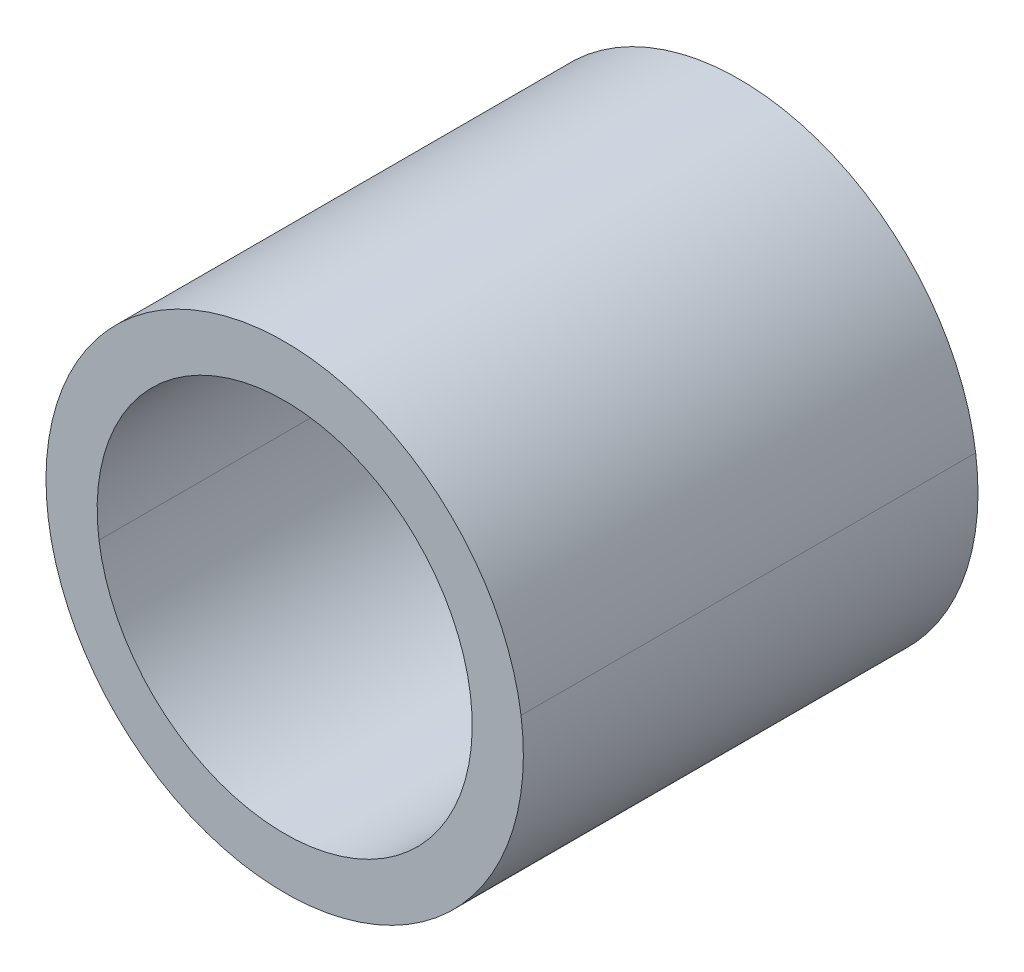
ISO-10303-21;
HEADER;
FILE_DESCRIPTION(('STEP AP214'),'2;1');
FILE_NAME('part.step','',(''),(''),'','','');
FILE_SCHEMA(('AUTOMOTIVE_DESIGN { 1 0 10303 214 1 1 1 1 }'));
ENDSEC;
DATA;
#1=APPLICATION_CONTEXT('core data for automotive mechanical design processes');
#2=APPLICATION_PROTOCOL_DEFINITION('international standard','automotive_design',2000,#1);
#3=PRODUCT_CONTEXT('',#1,'mechanical');
#4=PRODUCT('Part','Part','',(#3));
#5=PRODUCT_RELATED_PRODUCT_CATEGORY('part','',(#4));
#6=PRODUCT_DEFINITION_FORMATION('','',#4);
#7=PRODUCT_DEFINITION_CONTEXT('part definition',#1,'design');
#8=PRODUCT_DEFINITION('design','',#6,#7);
#9=PRODUCT_DEFINITION_SHAPE('','',#8);
#10=(LENGTH_UNIT() NAMED_UNIT(*) SI_UNIT(.MILLI.,.METRE.));
#11=(NAMED_UNIT(*) PLANE_ANGLE_UNIT() SI_UNIT($,.RADIAN.));
#12=(NAMED_UNIT(*) SI_UNIT($,.STERADIAN.) SOLID_ANGLE_UNIT());
#13=UNCERTAINTY_MEASURE_WITH_UNIT(LENGTH_MEASURE(1.E-05),#10,'distance_accuracy_value','');
#14=(GEOMETRIC_REPRESENTATION_CONTEXT(3) GLOBAL_UNCERTAINTY_ASSIGNED_CONTEXT((#13)) GLOBAL_UNIT_ASSIGNED_CONTEXT((#10,
#11,#12)) REPRESENTATION_CONTEXT('',''));
#15=CARTESIAN_POINT('',(0.,0.,0.));
#16=DIRECTION('',(0.,0.,1.));
#17=DIRECTION('',(1.,0.,0.));
#18=AXIS2_PLACEMENT_3D('',#15,#16,#17);
#19=CARTESIAN_POINT('',(-7.48965146438231,-0.284044859426387,-18.3));
#20=DIRECTION('',(0.,0.,-1.));
#21=DIRECTION('',(0.990268068741566,0.139173100960095,0.));
#22=AXIS2_PLACEMENT_3D('',#19,#20,#21);
#23=CYLINDRICAL_SURFACE('',#22,0.825);
#24=DIRECTION('',(0.,0.,-1.));
#25=VECTOR('',#24,1.);
#26=CARTESIAN_POINT('',(-6.67268030767052,-0.169227051134309,-15.8));
#27=LINE('',#26,#25);
#28=CARTESIAN_POINT('',(-6.67268030767052,-0.169227051134309,-15.8));
#29=VERTEX_POINT('',#28);
#30=CARTESIAN_POINT('',(-6.67268030767052,-0.169227051134309,-17.8));
#31=VERTEX_POINT('',#30);
#32=EDGE_CURVE('E11',#29,#31,#27,.T.);
#33=ORIENTED_EDGE('',*,*,#32,.T.);
#34=CARTESIAN_POINT('',(-7.48965146438231,-0.284044859426387,-17.8));
#35=DIRECTION('',(0.,0.,1.));
#36=DIRECTION('',(-0.990268068741566,-0.139173100960095,0.));
#37=AXIS2_PLACEMENT_3D('',#34,#35,#36);
#38=CIRCLE('',#37,0.825);
#39=CARTESIAN_POINT('',(-8.30662262109411,-0.398862667718466,-17.8));
#40=VERTEX_POINT('',#39);
#41=EDGE_CURVE('E66',#40,#31,#38,.T.);
#42=ORIENTED_EDGE('',*,*,#41,.F.);
#43=DIRECTION('',(0.,0.,-1.));
#44=VECTOR('',#43,1.);
#45=CARTESIAN_POINT('',(-8.30662262109411,-0.398862667718466,-15.8));
#46=LINE('',#45,#44);
#47=CARTESIAN_POINT('',(-8.30662262109411,-0.398862667718466,-15.8));
#48=VERTEX_POINT('',#47);
#49=EDGE_CURVE('E25',#48,#40,#46,.T.);
#50=ORIENTED_EDGE('',*,*,#49,.F.);
#51=CARTESIAN_POINT('',(-7.48965146438231,-0.284044859426387,-15.8));
#52=DIRECTION('',(0.,0.,-1.));
#53=DIRECTION('',(0.990268068741566,0.139173100960095,0.));
#54=AXIS2_PLACEMENT_3D('',#51,#52,#53);
#55=CIRCLE('',#54,0.825);
#56=EDGE_CURVE('E63',#29,#48,#55,.T.);
#57=ORIENTED_EDGE('',*,*,#56,.F.);
#58=EDGE_LOOP('',(#33,#42,#50,#57));
#59=FACE_BOUND('',#58,.T.);
#60=ADVANCED_FACE('F17',(#59),#23,.F.);
#61=CARTESIAN_POINT('',(-7.48965146438231,-0.284044859426387,-18.3));
#62=DIRECTION('',(0.,0.,-1.));
#63=DIRECTION('',(0.990268068741566,0.139173100960095,0.));
#64=AXIS2_PLACEMENT_3D('',#61,#62,#63);
#65=CYLINDRICAL_SURFACE('',#64,0.825);
#66=ORIENTED_EDGE('',*,*,#49,.T.);
#67=CARTESIAN_POINT('',(-7.48965146438231,-0.284044859426387,-17.8));
#68=DIRECTION('',(0.,0.,1.));
#69=DIRECTION('',(0.990268068741566,0.139173100960095,0.));
#70=AXIS2_PLACEMENT_3D('',#67,#68,#69);
#71=CIRCLE('',#70,0.825);
#72=EDGE_CURVE('E68',#31,#40,#71,.T.);
#73=ORIENTED_EDGE('',*,*,#72,.F.);
#74=ORIENTED_EDGE('',*,*,#32,.F.);
#75=CARTESIAN_POINT('',(-7.48965146438231,-0.284044859426387,-15.8));
#76=DIRECTION('',(0.,0.,-1.));
#77=DIRECTION('',(-0.990268068741566,-0.139173100960095,0.));
#78=AXIS2_PLACEMENT_3D('',#75,#76,#77);
#79=CIRCLE('',#78,0.825);
#80=EDGE_CURVE('E72',#48,#29,#79,.T.);
#81=ORIENTED_EDGE('',*,*,#80,.F.);
#82=EDGE_LOOP('',(#66,#73,#74,#81));
#83=FACE_BOUND('',#82,.T.);
#84=ADVANCED_FACE('F76',(#83),#65,.F.);
#85=CARTESIAN_POINT('',(-7.48965146438231,-0.284044859426387,-17.8));
#86=DIRECTION('',(0.,0.,1.));
#87=DIRECTION('',(1.,0.,0.));
#88=AXIS2_PLACEMENT_3D('',#85,#86,#87);
#89=PLANE('',#88);
#90=ORIENTED_EDGE('',*,*,#41,.T.);
#91=ORIENTED_EDGE('',*,*,#72,.T.);
#92=EDGE_LOOP('',(#90,#91));
#93=FACE_BOUND('',#92,.T.);
#94=CARTESIAN_POINT('',(-7.48965146438231,-0.284044859426387,-17.8));
#95=DIRECTION('',(0.,0.,-1.));
#96=DIRECTION('',(-0.990268068741566,-0.139173100960095,0.));
#97=AXIS2_PLACEMENT_3D('',#94,#95,#96);
#98=CIRCLE('',#97,1.05);
#99=CARTESIAN_POINT('',(-8.52943293656096,-0.430176615434488,-17.8));
#100=VERTEX_POINT('',#99);
#101=CARTESIAN_POINT('',(-6.44986999220367,-0.137913103418287,-17.8));
#102=VERTEX_POINT('',#101);
#103=EDGE_CURVE('E102',#100,#102,#98,.T.);
#104=ORIENTED_EDGE('',*,*,#103,.T.);
#105=CARTESIAN_POINT('',(-7.48965146438231,-0.284044859426387,-17.8));
#106=DIRECTION('',(0.,0.,-1.));
#107=DIRECTION('',(0.990268068741566,0.139173100960095,0.));
#108=AXIS2_PLACEMENT_3D('',#105,#106,#107);
#109=CIRCLE('',#108,1.05);
#110=EDGE_CURVE('E74',#102,#100,#109,.T.);
#111=ORIENTED_EDGE('',*,*,#110,.T.);
#112=EDGE_LOOP('',(#104,#111));
#113=FACE_BOUND('',#112,.T.);
#114=ADVANCED_FACE('F96',(#93,#113),#89,.F.);
#115=CARTESIAN_POINT('',(-7.48965146438231,-0.284044859426387,-18.3));
#116=DIRECTION('',(0.,0.,-1.));
#117=DIRECTION('',(0.990268068741566,0.139173100960095,0.));
#118=AXIS2_PLACEMENT_3D('',#115,#116,#117);
#119=CYLINDRICAL_SURFACE('',#118,1.05);
#120=DIRECTION('',(0.,0.,-1.));
#121=VECTOR('',#120,1.);
#122=CARTESIAN_POINT('',(-8.52943293656096,-0.430176615434488,-15.8));
#123=LINE('',#122,#121);
#124=CARTESIAN_POINT('',(-8.52943293656096,-0.430176615434488,-15.8));
#125=VERTEX_POINT('',#124);
#126=EDGE_CURVE('E110',#125,#100,#123,.T.);
#127=ORIENTED_EDGE('',*,*,#126,.T.);
#128=ORIENTED_EDGE('',*,*,#110,.F.);
#129=DIRECTION('',(0.,0.,-1.));
#130=VECTOR('',#129,1.);
#131=CARTESIAN_POINT('',(-6.44986999220367,-0.137913103418287,-15.8));
#132=LINE('',#131,#130);
#133=CARTESIAN_POINT('',(-6.44986999220367,-0.137913103418287,-15.8));
#134=VERTEX_POINT('',#133);
#135=EDGE_CURVE('E111',#134,#102,#132,.T.);
#136=ORIENTED_EDGE('',*,*,#135,.F.);
#137=CARTESIAN_POINT('',(-7.48965146438231,-0.284044859426387,-15.8));
#138=DIRECTION('',(0.,0.,1.));
#139=DIRECTION('',(-0.990268068741566,-0.139173100960095,0.));
#140=AXIS2_PLACEMENT_3D('',#137,#138,#139);
#141=CIRCLE('',#140,1.05);
#142=EDGE_CURVE('E78',#125,#134,#141,.T.);
#143=ORIENTED_EDGE('',*,*,#142,.F.);
#144=EDGE_LOOP('',(#127,#128,#136,#143));
#145=FACE_BOUND('',#144,.T.);
#146=ADVANCED_FACE('F99',(#145),#119,.T.);
#147=CARTESIAN_POINT('',(-7.48965146438231,-0.284044859426387,-15.8));
#148=DIRECTION('',(0.,0.,1.));
#149=DIRECTION('',(1.,0.,0.));
#150=AXIS2_PLACEMENT_3D('',#147,#148,#149);
#151=PLANE('',#150);
#152=ORIENTED_EDGE('',*,*,#80,.T.);
#153=ORIENTED_EDGE('',*,*,#56,.T.);
#154=EDGE_LOOP('',(#152,#153));
#155=FACE_BOUND('',#154,.T.);
#156=ORIENTED_EDGE('',*,*,#142,.T.);
#157=CARTESIAN_POINT('',(-7.48965146438231,-0.284044859426387,-15.8));
#158=DIRECTION('',(0.,0.,1.));
#159=DIRECTION('',(0.990268068741566,0.139173100960095,0.));
#160=AXIS2_PLACEMENT_3D('',#157,#158,#159);
#161=CIRCLE('',#160,1.05);
#162=EDGE_CURVE('E85',#134,#125,#161,.T.);
#163=ORIENTED_EDGE('',*,*,#162,.T.);
#164=EDGE_LOOP('',(#156,#163));
#165=FACE_BOUND('',#164,.T.);
#166=ADVANCED_FACE('F70',(#155,#165),#151,.T.);
#167=CARTESIAN_POINT('',(-7.48965146438231,-0.284044859426387,-18.3));
#168=DIRECTION('',(0.,0.,-1.));
#169=DIRECTION('',(0.990268068741566,0.139173100960095,0.));
#170=AXIS2_PLACEMENT_3D('',#167,#168,#169);
#171=CYLINDRICAL_SURFACE('',#170,1.05);
#172=ORIENTED_EDGE('',*,*,#135,.T.);
#173=ORIENTED_EDGE('',*,*,#103,.F.);
#174=ORIENTED_EDGE('',*,*,#126,.F.);
#175=ORIENTED_EDGE('',*,*,#162,.F.);
#176=EDGE_LOOP('',(#172,#173,#174,#175));
#177=FACE_BOUND('',#176,.T.);
#178=ADVANCED_FACE('F115',(#177),#171,.T.);
#179=CLOSED_SHELL('',(#60,#84,#114,#146,#166,#178));
#180=MANIFOLD_SOLID_BREP('B1',#179);
#181=ADVANCED_BREP_SHAPE_REPRESENTATION('',(#18,#180),#14);
#182=SHAPE_DEFINITION_REPRESENTATION(#9,#181);
ENDSEC;
END-ISO-10303-21;
